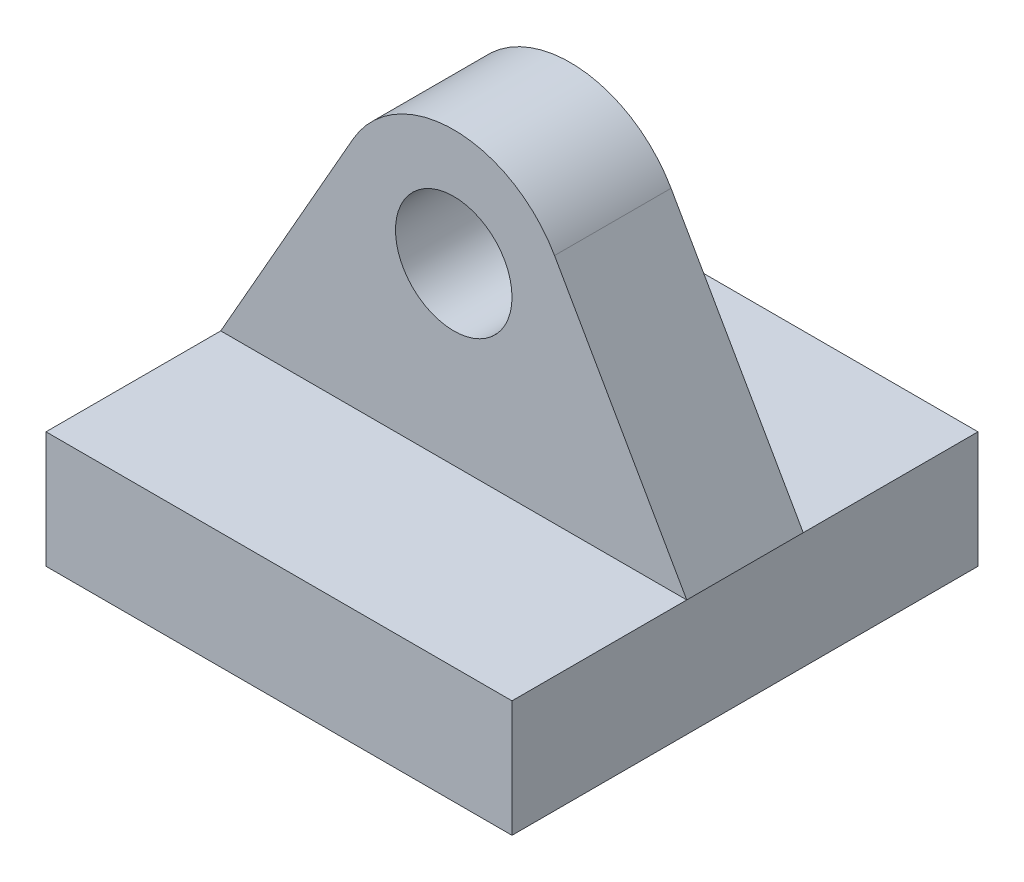
ISO-10303-21;
HEADER;
FILE_DESCRIPTION(('STEP AP214'),'2;1');
FILE_NAME('part.step','',(''),(''),'','','');
FILE_SCHEMA(('AUTOMOTIVE_DESIGN { 1 0 10303 214 1 1 1 1 }'));
ENDSEC;
DATA;
#1=APPLICATION_CONTEXT('core data for automotive mechanical design processes');
#2=APPLICATION_PROTOCOL_DEFINITION('international standard','automotive_design',2000,#1);
#3=PRODUCT_CONTEXT('',#1,'mechanical');
#4=PRODUCT('Part','Part','',(#3));
#5=PRODUCT_RELATED_PRODUCT_CATEGORY('part','',(#4));
#6=PRODUCT_DEFINITION_FORMATION('','',#4);
#7=PRODUCT_DEFINITION_CONTEXT('part definition',#1,'design');
#8=PRODUCT_DEFINITION('design','',#6,#7);
#9=PRODUCT_DEFINITION_SHAPE('','',#8);
#10=(LENGTH_UNIT() NAMED_UNIT(*) SI_UNIT(.MILLI.,.METRE.));
#11=(NAMED_UNIT(*) PLANE_ANGLE_UNIT() SI_UNIT($,.RADIAN.));
#12=(NAMED_UNIT(*) SI_UNIT($,.STERADIAN.) SOLID_ANGLE_UNIT());
#13=UNCERTAINTY_MEASURE_WITH_UNIT(LENGTH_MEASURE(1.E-05),#10,'distance_accuracy_value','');
#14=(GEOMETRIC_REPRESENTATION_CONTEXT(3) GLOBAL_UNCERTAINTY_ASSIGNED_CONTEXT((#13)) GLOBAL_UNIT_ASSIGNED_CONTEXT((#10,
#11,#12)) REPRESENTATION_CONTEXT('',''));
#15=CARTESIAN_POINT('',(0.,0.,0.));
#16=DIRECTION('',(0.,0.,1.));
#17=DIRECTION('',(1.,0.,0.));
#18=AXIS2_PLACEMENT_3D('',#15,#16,#17);
#19=CARTESIAN_POINT('',(-12.7,3.175,12.7));
#20=DIRECTION('',(0.,-1.,0.));
#21=DIRECTION('',(0.,0.,-1.));
#22=AXIS2_PLACEMENT_3D('',#19,#20,#21);
#23=PLANE('',#22);
#24=DIRECTION('',(1.,0.,0.));
#25=VECTOR('',#24,1.);
#26=CARTESIAN_POINT('',(-12.7,3.175,3.175));
#27=LINE('',#26,#25);
#28=CARTESIAN_POINT('',(-12.7,3.175,3.175));
#29=VERTEX_POINT('',#28);
#30=CARTESIAN_POINT('',(12.7,3.175,3.175));
#31=VERTEX_POINT('',#30);
#32=EDGE_CURVE('E98',#29,#31,#27,.T.);
#33=ORIENTED_EDGE('',*,*,#32,.F.);
#34=DIRECTION('',(0.,0.,-1.));
#35=VECTOR('',#34,1.);
#36=CARTESIAN_POINT('',(-12.7,3.175,12.7));
#37=LINE('',#36,#35);
#38=CARTESIAN_POINT('',(-12.7,3.175,12.7));
#39=VERTEX_POINT('',#38);
#40=EDGE_CURVE('E168',#39,#29,#37,.T.);
#41=ORIENTED_EDGE('',*,*,#40,.F.);
#42=DIRECTION('',(-1.,0.,0.));
#43=VECTOR('',#42,1.);
#44=CARTESIAN_POINT('',(-12.7,3.175,12.7));
#45=LINE('',#44,#43);
#46=CARTESIAN_POINT('',(12.7,3.175,12.7));
#47=VERTEX_POINT('',#46);
#48=EDGE_CURVE('E100',#47,#39,#45,.T.);
#49=ORIENTED_EDGE('',*,*,#48,.F.);
#50=DIRECTION('',(0.,0.,-1.));
#51=VECTOR('',#50,1.);
#52=CARTESIAN_POINT('',(12.7,3.175,12.7));
#53=LINE('',#52,#51);
#54=EDGE_CURVE('E11',#47,#31,#53,.T.);
#55=ORIENTED_EDGE('',*,*,#54,.T.);
#56=EDGE_LOOP('',(#33,#41,#49,#55));
#57=FACE_BOUND('',#56,.T.);
#58=ADVANCED_FACE('F33',(#57),#23,.F.);
#59=CARTESIAN_POINT('',(12.7,-3.175,12.7));
#60=DIRECTION('',(-1.,0.,0.));
#61=DIRECTION('',(0.,0.,1.));
#62=AXIS2_PLACEMENT_3D('',#59,#60,#61);
#63=PLANE('',#62);
#64=DIRECTION('',(0.,1.,0.));
#65=VECTOR('',#64,1.);
#66=CARTESIAN_POINT('',(12.7,-3.175,-12.7));
#67=LINE('',#66,#65);
#68=CARTESIAN_POINT('',(12.7,-3.175,-12.7));
#69=VERTEX_POINT('',#68);
#70=CARTESIAN_POINT('',(12.7,3.175,-12.7));
#71=VERTEX_POINT('',#70);
#72=EDGE_CURVE('E110',#69,#71,#67,.T.);
#73=ORIENTED_EDGE('',*,*,#72,.T.);
#74=CARTESIAN_POINT('',(12.7,3.175,-3.175));
#75=VERTEX_POINT('',#74);
#76=EDGE_CURVE('E41',#75,#71,#53,.T.);
#77=ORIENTED_EDGE('',*,*,#76,.F.);
#78=DIRECTION('',(0.,0.,-1.));
#79=VECTOR('',#78,1.);
#80=CARTESIAN_POINT('',(12.7,3.175,3.175));
#81=LINE('',#80,#79);
#82=EDGE_CURVE('E105',#31,#75,#81,.T.);
#83=ORIENTED_EDGE('',*,*,#82,.F.);
#84=ORIENTED_EDGE('',*,*,#54,.F.);
#85=DIRECTION('',(0.,1.,0.));
#86=VECTOR('',#85,1.);
#87=CARTESIAN_POINT('',(12.7,-3.175,12.7));
#88=LINE('',#87,#86);
#89=CARTESIAN_POINT('',(12.7,-3.175,12.7));
#90=VERTEX_POINT('',#89);
#91=EDGE_CURVE('E149',#90,#47,#88,.T.);
#92=ORIENTED_EDGE('',*,*,#91,.F.);
#93=DIRECTION('',(0.,0.,-1.));
#94=VECTOR('',#93,1.);
#95=CARTESIAN_POINT('',(12.7,-3.175,12.7));
#96=LINE('',#95,#94);
#97=EDGE_CURVE('E157',#90,#69,#96,.T.);
#98=ORIENTED_EDGE('',*,*,#97,.T.);
#99=EDGE_LOOP('',(#73,#77,#83,#84,#92,#98));
#100=FACE_BOUND('',#99,.T.);
#101=ADVANCED_FACE('F35',(#100),#63,.F.);
#102=CARTESIAN_POINT('',(-12.7,3.175,-3.175));
#103=VERTEX_POINT('',#102);
#104=CARTESIAN_POINT('',(-12.7,3.175,-12.7));
#105=VERTEX_POINT('',#104);
#106=EDGE_CURVE('E53',#103,#105,#37,.T.);
#107=ORIENTED_EDGE('',*,*,#106,.F.);
#108=DIRECTION('',(1.,0.,0.));
#109=VECTOR('',#108,1.);
#110=CARTESIAN_POINT('',(-12.7,3.175,-3.175));
#111=LINE('',#110,#109);
#112=EDGE_CURVE('E48',#103,#75,#111,.T.);
#113=ORIENTED_EDGE('',*,*,#112,.T.);
#114=ORIENTED_EDGE('',*,*,#76,.T.);
#115=DIRECTION('',(-1.,0.,0.));
#116=VECTOR('',#115,1.);
#117=CARTESIAN_POINT('',(-12.7,3.175,-12.7));
#118=LINE('',#117,#116);
#119=EDGE_CURVE('E159',#71,#105,#118,.T.);
#120=ORIENTED_EDGE('',*,*,#119,.T.);
#121=EDGE_LOOP('',(#107,#113,#114,#120));
#122=FACE_BOUND('',#121,.T.);
#123=ADVANCED_FACE('F175',(#122),#23,.F.);
#124=CARTESIAN_POINT('',(-12.7,-3.175,12.7));
#125=DIRECTION('',(1.,0.,0.));
#126=DIRECTION('',(0.,0.,-1.));
#127=AXIS2_PLACEMENT_3D('',#124,#125,#126);
#128=PLANE('',#127);
#129=DIRECTION('',(0.,-1.,0.));
#130=VECTOR('',#129,1.);
#131=CARTESIAN_POINT('',(-12.7,-3.175,-12.7));
#132=LINE('',#131,#130);
#133=CARTESIAN_POINT('',(-12.7,-3.175,-12.7));
#134=VERTEX_POINT('',#133);
#135=EDGE_CURVE('E161',#105,#134,#132,.T.);
#136=ORIENTED_EDGE('',*,*,#135,.T.);
#137=DIRECTION('',(0.,0.,-1.));
#138=VECTOR('',#137,1.);
#139=CARTESIAN_POINT('',(-12.7,-3.175,12.7));
#140=LINE('',#139,#138);
#141=CARTESIAN_POINT('',(-12.7,-3.175,12.7));
#142=VERTEX_POINT('',#141);
#143=EDGE_CURVE('E166',#142,#134,#140,.T.);
#144=ORIENTED_EDGE('',*,*,#143,.F.);
#145=DIRECTION('',(0.,-1.,0.));
#146=VECTOR('',#145,1.);
#147=CARTESIAN_POINT('',(-12.7,-3.175,12.7));
#148=LINE('',#147,#146);
#149=EDGE_CURVE('E153',#39,#142,#148,.T.);
#150=ORIENTED_EDGE('',*,*,#149,.F.);
#151=ORIENTED_EDGE('',*,*,#40,.T.);
#152=DIRECTION('',(0.,0.,-1.));
#153=VECTOR('',#152,1.);
#154=CARTESIAN_POINT('',(-12.7,3.175,3.175));
#155=LINE('',#154,#153);
#156=EDGE_CURVE('E138',#29,#103,#155,.T.);
#157=ORIENTED_EDGE('',*,*,#156,.T.);
#158=ORIENTED_EDGE('',*,*,#106,.T.);
#159=EDGE_LOOP('',(#136,#144,#150,#151,#157,#158));
#160=FACE_BOUND('',#159,.T.);
#161=ADVANCED_FACE('F171',(#160),#128,.F.);
#162=CARTESIAN_POINT('',(-12.7,-3.175,12.7));
#163=DIRECTION('',(0.,1.,0.));
#164=DIRECTION('',(0.,0.,1.));
#165=AXIS2_PLACEMENT_3D('',#162,#163,#164);
#166=PLANE('',#165);
#167=DIRECTION('',(1.,0.,0.));
#168=VECTOR('',#167,1.);
#169=CARTESIAN_POINT('',(-12.7,-3.175,-12.7));
#170=LINE('',#169,#168);
#171=EDGE_CURVE('E151',#134,#69,#170,.T.);
#172=ORIENTED_EDGE('',*,*,#171,.T.);
#173=ORIENTED_EDGE('',*,*,#97,.F.);
#174=DIRECTION('',(1.,0.,0.));
#175=VECTOR('',#174,1.);
#176=CARTESIAN_POINT('',(-12.7,-3.175,12.7));
#177=LINE('',#176,#175);
#178=EDGE_CURVE('E155',#142,#90,#177,.T.);
#179=ORIENTED_EDGE('',*,*,#178,.F.);
#180=ORIENTED_EDGE('',*,*,#143,.T.);
#181=EDGE_LOOP('',(#172,#173,#179,#180));
#182=FACE_BOUND('',#181,.T.);
#183=ADVANCED_FACE('F182',(#182),#166,.F.);
#184=CARTESIAN_POINT('',(0.,0.,12.7));
#185=DIRECTION('',(0.,0.,-1.));
#186=DIRECTION('',(-1.,0.,0.));
#187=AXIS2_PLACEMENT_3D('',#184,#185,#186);
#188=PLANE('',#187);
#189=ORIENTED_EDGE('',*,*,#91,.T.);
#190=ORIENTED_EDGE('',*,*,#48,.T.);
#191=ORIENTED_EDGE('',*,*,#149,.T.);
#192=ORIENTED_EDGE('',*,*,#178,.T.);
#193=EDGE_LOOP('',(#189,#190,#191,#192));
#194=FACE_BOUND('',#193,.T.);
#195=ADVANCED_FACE('F185',(#194),#188,.F.);
#196=CARTESIAN_POINT('',(0.,0.,-12.7));
#197=DIRECTION('',(0.,0.,-1.));
#198=DIRECTION('',(-1.,0.,0.));
#199=AXIS2_PLACEMENT_3D('',#196,#197,#198);
#200=PLANE('',#199);
#201=ORIENTED_EDGE('',*,*,#72,.F.);
#202=ORIENTED_EDGE('',*,*,#171,.F.);
#203=ORIENTED_EDGE('',*,*,#135,.F.);
#204=ORIENTED_EDGE('',*,*,#119,.F.);
#205=EDGE_LOOP('',(#201,#202,#203,#204));
#206=FACE_BOUND('',#205,.T.);
#207=ADVANCED_FACE('F179',(#206),#200,.T.);
#208=CARTESIAN_POINT('',(0.,12.7,3.175));
#209=DIRECTION('',(0.,0.,1.));
#210=DIRECTION('',(1.,0.,0.));
#211=AXIS2_PLACEMENT_3D('',#208,#209,#210);
#212=PLANE('',#211);
#213=ORIENTED_EDGE('',*,*,#32,.T.);
#214=DIRECTION('',(-0.494877521788832,0.868962737076881,0.));
#215=VECTOR('',#214,1.);
#216=CARTESIAN_POINT('',(12.7,3.175,3.175));
#217=LINE('',#216,#215);
#218=CARTESIAN_POINT('',(5.49368527930239,15.8286742693415,3.175));
#219=VERTEX_POINT('',#218);
#220=EDGE_CURVE('E114',#31,#219,#217,.T.);
#221=ORIENTED_EDGE('',*,*,#220,.T.);
#222=CARTESIAN_POINT('',(0.,12.7,3.175));
#223=DIRECTION('',(0.,0.,1.));
#224=DIRECTION('',(1.,0.,0.));
#225=AXIS2_PLACEMENT_3D('',#222,#223,#224);
#226=CIRCLE('',#225,6.32211836583776);
#227=CARTESIAN_POINT('',(-5.49368527930239,15.8286742693415,3.175));
#228=VERTEX_POINT('',#227);
#229=EDGE_CURVE('E119',#219,#228,#226,.T.);
#230=ORIENTED_EDGE('',*,*,#229,.T.);
#231=DIRECTION('',(-0.494877521788832,-0.868962737076881,0.));
#232=VECTOR('',#231,1.);
#233=CARTESIAN_POINT('',(-12.7,3.175,3.175));
#234=LINE('',#233,#232);
#235=EDGE_CURVE('E125',#228,#29,#234,.T.);
#236=ORIENTED_EDGE('',*,*,#235,.T.);
#237=EDGE_LOOP('',(#213,#221,#230,#236));
#238=FACE_BOUND('',#237,.T.);
#239=CARTESIAN_POINT('',(0.,12.7,3.175));
#240=DIRECTION('',(0.,0.,1.));
#241=DIRECTION('',(1.,0.,0.));
#242=AXIS2_PLACEMENT_3D('',#239,#240,#241);
#243=CIRCLE('',#242,3.175);
#244=CARTESIAN_POINT('',(3.175,12.7,3.175));
#245=VERTEX_POINT('',#244);
#246=EDGE_CURVE('E141',#245,#245,#243,.T.);
#247=ORIENTED_EDGE('',*,*,#246,.F.);
#248=EDGE_LOOP('',(#247));
#249=FACE_BOUND('',#248,.T.);
#250=ADVANCED_FACE('F122',(#238,#249),#212,.T.);
#251=CARTESIAN_POINT('',(0.,12.7,-3.175));
#252=DIRECTION('',(0.,0.,1.));
#253=DIRECTION('',(1.,0.,0.));
#254=AXIS2_PLACEMENT_3D('',#251,#252,#253);
#255=PLANE('',#254);
#256=ORIENTED_EDGE('',*,*,#112,.F.);
#257=DIRECTION('',(-0.494877521788832,-0.868962737076881,0.));
#258=VECTOR('',#257,1.);
#259=CARTESIAN_POINT('',(-12.7,3.175,-3.175));
#260=LINE('',#259,#258);
#261=CARTESIAN_POINT('',(-5.49368527930239,15.8286742693415,-3.175));
#262=VERTEX_POINT('',#261);
#263=EDGE_CURVE('E127',#262,#103,#260,.T.);
#264=ORIENTED_EDGE('',*,*,#263,.F.);
#265=CARTESIAN_POINT('',(0.,12.7,-3.175));
#266=DIRECTION('',(0.,0.,1.));
#267=DIRECTION('',(1.,0.,0.));
#268=AXIS2_PLACEMENT_3D('',#265,#266,#267);
#269=CIRCLE('',#268,6.32211836583776);
#270=CARTESIAN_POINT('',(5.49368527930239,15.8286742693415,-3.175));
#271=VERTEX_POINT('',#270);
#272=EDGE_CURVE('E130',#271,#262,#269,.T.);
#273=ORIENTED_EDGE('',*,*,#272,.F.);
#274=DIRECTION('',(-0.494877521788832,0.868962737076881,0.));
#275=VECTOR('',#274,1.);
#276=CARTESIAN_POINT('',(12.7,3.175,-3.175));
#277=LINE('',#276,#275);
#278=EDGE_CURVE('E140',#75,#271,#277,.T.);
#279=ORIENTED_EDGE('',*,*,#278,.F.);
#280=EDGE_LOOP('',(#256,#264,#273,#279));
#281=FACE_BOUND('',#280,.T.);
#282=CARTESIAN_POINT('',(0.,12.7,-3.175));
#283=DIRECTION('',(0.,0.,1.));
#284=DIRECTION('',(1.,0.,0.));
#285=AXIS2_PLACEMENT_3D('',#282,#283,#284);
#286=CIRCLE('',#285,3.175);
#287=CARTESIAN_POINT('',(3.175,12.7,-3.175));
#288=VERTEX_POINT('',#287);
#289=EDGE_CURVE('E133',#288,#288,#286,.T.);
#290=ORIENTED_EDGE('',*,*,#289,.T.);
#291=EDGE_LOOP('',(#290));
#292=FACE_BOUND('',#291,.T.);
#293=ADVANCED_FACE('F246',(#281,#292),#255,.F.);
#294=CARTESIAN_POINT('',(12.7,3.175,3.175));
#295=DIRECTION('',(-0.86896273707688,-0.494877521788832,0.));
#296=DIRECTION('',(0.494877521788832,-0.868962737076881,0.));
#297=AXIS2_PLACEMENT_3D('',#294,#295,#296);
#298=PLANE('',#297);
#299=ORIENTED_EDGE('',*,*,#278,.T.);
#300=DIRECTION('',(0.,0.,-1.));
#301=VECTOR('',#300,1.);
#302=CARTESIAN_POINT('',(5.49368527930239,15.8286742693415,3.175));
#303=LINE('',#302,#301);
#304=EDGE_CURVE('E111',#219,#271,#303,.T.);
#305=ORIENTED_EDGE('',*,*,#304,.F.);
#306=ORIENTED_EDGE('',*,*,#220,.F.);
#307=ORIENTED_EDGE('',*,*,#82,.T.);
#308=EDGE_LOOP('',(#299,#305,#306,#307));
#309=FACE_BOUND('',#308,.T.);
#310=ADVANCED_FACE('F115',(#309),#298,.F.);
#311=CARTESIAN_POINT('',(0.,12.7,3.175));
#312=DIRECTION('',(0.,0.,-1.));
#313=DIRECTION('',(-1.,0.,0.));
#314=AXIS2_PLACEMENT_3D('',#311,#312,#313);
#315=CYLINDRICAL_SURFACE('',#314,6.32211836583776);
#316=ORIENTED_EDGE('',*,*,#272,.T.);
#317=DIRECTION('',(0.,0.,-1.));
#318=VECTOR('',#317,1.);
#319=CARTESIAN_POINT('',(-5.49368527930239,15.8286742693415,3.175));
#320=LINE('',#319,#318);
#321=EDGE_CURVE('E145',#228,#262,#320,.T.);
#322=ORIENTED_EDGE('',*,*,#321,.F.);
#323=ORIENTED_EDGE('',*,*,#229,.F.);
#324=ORIENTED_EDGE('',*,*,#304,.T.);
#325=EDGE_LOOP('',(#316,#322,#323,#324));
#326=FACE_BOUND('',#325,.T.);
#327=ADVANCED_FACE('F262',(#326),#315,.T.);
#328=CARTESIAN_POINT('',(-12.7,3.175,3.175));
#329=DIRECTION('',(0.86896273707688,-0.494877521788832,0.));
#330=DIRECTION('',(0.494877521788832,0.868962737076881,0.));
#331=AXIS2_PLACEMENT_3D('',#328,#329,#330);
#332=PLANE('',#331);
#333=ORIENTED_EDGE('',*,*,#263,.T.);
#334=ORIENTED_EDGE('',*,*,#156,.F.);
#335=ORIENTED_EDGE('',*,*,#235,.F.);
#336=ORIENTED_EDGE('',*,*,#321,.T.);
#337=EDGE_LOOP('',(#333,#334,#335,#336));
#338=FACE_BOUND('',#337,.T.);
#339=ADVANCED_FACE('F269',(#338),#332,.F.);
#340=CARTESIAN_POINT('',(0.,12.7,3.175));
#341=DIRECTION('',(0.,0.,-1.));
#342=DIRECTION('',(-1.,0.,0.));
#343=AXIS2_PLACEMENT_3D('',#340,#341,#342);
#344=CYLINDRICAL_SURFACE('',#343,3.175);
#345=ORIENTED_EDGE('',*,*,#246,.T.);
#346=EDGE_LOOP('',(#345));
#347=FACE_BOUND('',#346,.T.);
#348=ORIENTED_EDGE('',*,*,#289,.F.);
#349=EDGE_LOOP('',(#348));
#350=FACE_BOUND('',#349,.T.);
#351=ADVANCED_FACE('F278',(#347,#350),#344,.F.);
#352=CLOSED_SHELL('',(#58,#101,#123,#161,#183,#195,#207,#250,#293,#310,#327,#339,#351));
#353=MANIFOLD_SOLID_BREP('B2',#352);
#354=ADVANCED_BREP_SHAPE_REPRESENTATION('',(#18,#353),#14);
#355=SHAPE_DEFINITION_REPRESENTATION(#9,#354);
ENDSEC;
END-ISO-10303-21;
